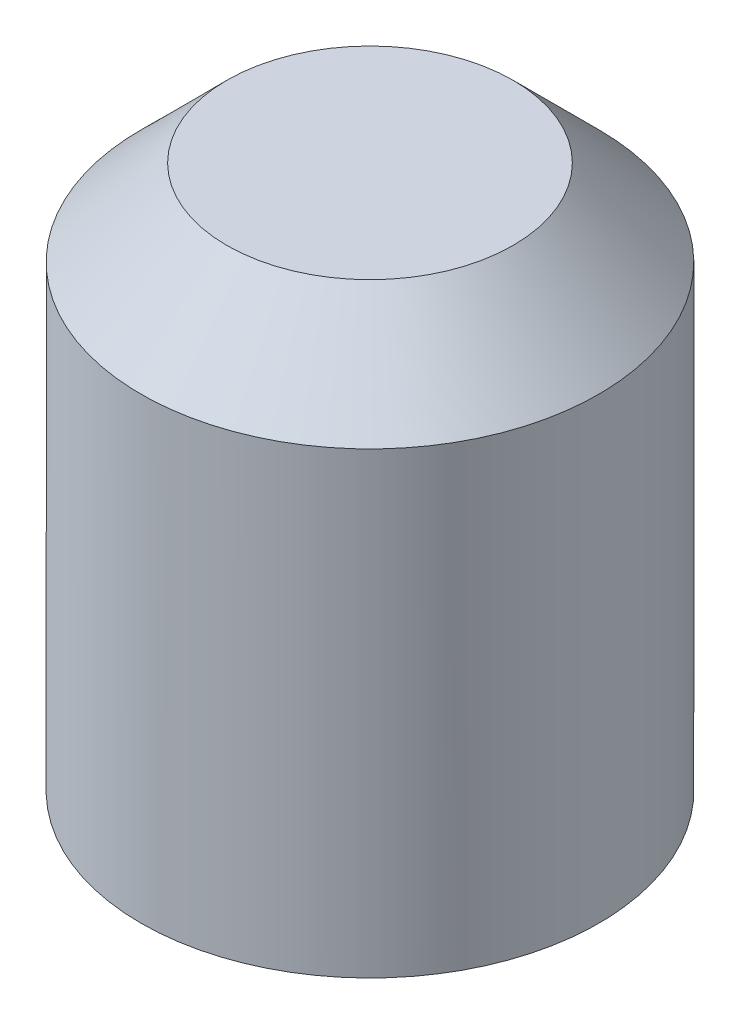
ISO-10303-21;
HEADER;
FILE_DESCRIPTION(('STEP AP214'),'2;1');
FILE_NAME('part.step','',(''),(''),'','','');
FILE_SCHEMA(('AUTOMOTIVE_DESIGN { 1 0 10303 214 1 1 1 1 }'));
ENDSEC;
DATA;
#1=APPLICATION_CONTEXT('core data for automotive mechanical design processes');
#2=APPLICATION_PROTOCOL_DEFINITION('international standard','automotive_design',2000,#1);
#3=PRODUCT_CONTEXT('',#1,'mechanical');
#4=PRODUCT('Part','Part','',(#3));
#5=PRODUCT_RELATED_PRODUCT_CATEGORY('part','',(#4));
#6=PRODUCT_DEFINITION_FORMATION('','',#4);
#7=PRODUCT_DEFINITION_CONTEXT('part definition',#1,'design');
#8=PRODUCT_DEFINITION('design','',#6,#7);
#9=PRODUCT_DEFINITION_SHAPE('','',#8);
#10=(LENGTH_UNIT() NAMED_UNIT(*) SI_UNIT(.MILLI.,.METRE.));
#11=(NAMED_UNIT(*) PLANE_ANGLE_UNIT() SI_UNIT($,.RADIAN.));
#12=(NAMED_UNIT(*) SI_UNIT($,.STERADIAN.) SOLID_ANGLE_UNIT());
#13=UNCERTAINTY_MEASURE_WITH_UNIT(LENGTH_MEASURE(1.E-05),#10,'distance_accuracy_value','');
#14=(GEOMETRIC_REPRESENTATION_CONTEXT(3) GLOBAL_UNCERTAINTY_ASSIGNED_CONTEXT((#13)) GLOBAL_UNIT_ASSIGNED_CONTEXT((#10,
#11,#12)) REPRESENTATION_CONTEXT('',''));
#15=CARTESIAN_POINT('',(0.,0.,0.));
#16=DIRECTION('',(0.,0.,1.));
#17=DIRECTION('',(1.,0.,0.));
#18=AXIS2_PLACEMENT_3D('',#15,#16,#17);
#19=CARTESIAN_POINT('',(-7.87735026918963,-10.,-1.));
#20=DIRECTION('',(0.,0.,-1.));
#21=DIRECTION('',(-1.,0.,0.));
#22=AXIS2_PLACEMENT_3D('',#19,#20,#21);
#23=PLANE('',#22);
#24=DIRECTION('',(0.,1.,0.));
#25=VECTOR('',#24,1.);
#26=CARTESIAN_POINT('',(-6.72264973081037,-10.,-1.));
#27=LINE('',#26,#25);
#28=CARTESIAN_POINT('',(-6.72264973080795,-10.0000000000346,-1.00000000000603));
#29=VERTEX_POINT('',#28);
#30=CARTESIAN_POINT('',(-6.72264973081037,-8.5,-1.));
#31=VERTEX_POINT('',#30);
#32=EDGE_CURVE('E74',#29,#31,#27,.T.);
#33=ORIENTED_EDGE('',*,*,#32,.T.);
#34=DIRECTION('',(1.,0.,0.));
#35=VECTOR('',#34,1.);
#36=CARTESIAN_POINT('',(-7.3,-8.5,-1.));
#37=LINE('',#36,#35);
#38=CARTESIAN_POINT('',(-7.87735026918963,-8.5,-0.999999999999999));
#39=VERTEX_POINT('',#38);
#40=EDGE_CURVE('E261',#31,#39,#37,.F.);
#41=ORIENTED_EDGE('',*,*,#40,.T.);
#42=DIRECTION('',(0.,1.,0.));
#43=VECTOR('',#42,1.);
#44=CARTESIAN_POINT('',(-7.87735026918963,-10.,-0.999999999999998));
#45=LINE('',#44,#43);
#46=CARTESIAN_POINT('',(-7.87735026919245,-10.0000000000686,-0.999999999999999));
#47=VERTEX_POINT('',#46);
#48=EDGE_CURVE('E77',#39,#47,#45,.F.);
#49=ORIENTED_EDGE('',*,*,#48,.T.);
#50=CARTESIAN_POINT('',(-6.72264973081249,-10.0000000000303,-1.));
#51=CARTESIAN_POINT('',(-6.77004446291757,-9.98631688646596,-1.));
#52=CARTESIAN_POINT('',(-6.81781412942871,-9.9737896099871,-1.));
#53=CARTESIAN_POINT('',(-6.91412944760533,-9.95164920318649,-1.));
#54=CARTESIAN_POINT('',(-6.96267658445572,-9.94204259308874,-1.));
#55=CARTESIAN_POINT('',(-7.05922611584881,-9.9265940010351,-1.));
#56=CARTESIAN_POINT('',(-7.10721491698777,-9.92066965365338,-1.));
#57=CARTESIAN_POINT('',(-7.20346938392045,-9.9127165686833,-1.));
#58=CARTESIAN_POINT('',(-7.25173469196023,-9.91068360254859,-1.));
#59=CARTESIAN_POINT('',(-7.34826530804043,-9.91068360254859,-1.));
#60=CARTESIAN_POINT('',(-7.39653061608086,-9.91271656868335,-1.));
#61=CARTESIAN_POINT('',(-7.49278508301485,-9.92066965365365,-1.));
#62=CARTESIAN_POINT('',(-7.54077388415445,-9.92659400103553,-1.));
#63=CARTESIAN_POINT('',(-7.63732341554885,-9.94204259308957,-1.));
#64=CARTESIAN_POINT('',(-7.6858705523999,-9.95164920318757,-1.));
#65=CARTESIAN_POINT('',(-7.78218587057781,-9.97378960998872,-1.));
#66=CARTESIAN_POINT('',(-7.82995553708958,-9.98631688646789,-1.));
#67=CARTESIAN_POINT('',(-7.87735026919529,-10.0000000000325,-1.));
#68=B_SPLINE_CURVE_WITH_KNOTS('',3,(#50,#51,#52,#53,#54,#55,#56,#57,#58,#59,#60,#61,#62,#63,#64,
#65,#66,#67),.UNSPECIFIED.,.F.,.F.,(4,2,2,2,2,2,2,2,4),(0.,0.148036697958489,0.296401493043749,
0.44131542958406,0.586071806661002,0.730828183739915,0.875742120282206,1.02410691536954,
1.17214361333009),.UNSPECIFIED.);
#69=EDGE_CURVE('E21',#29,#47,#68,.T.);
#70=ORIENTED_EDGE('',*,*,#69,.F.);
#71=EDGE_LOOP('',(#33,#41,#49,#70));
#72=FACE_BOUND('',#71,.T.);
#73=ADVANCED_FACE('F17',(#72),#23,.F.);
#74=CARTESIAN_POINT('',(-6.72264973081037,-10.,1.));
#75=DIRECTION('',(0.,0.,1.));
#76=DIRECTION('',(1.,0.,0.));
#77=AXIS2_PLACEMENT_3D('',#74,#75,#76);
#78=PLANE('',#77);
#79=DIRECTION('',(0.,1.,0.));
#80=VECTOR('',#79,1.);
#81=CARTESIAN_POINT('',(-7.87735026918963,-10.,1.));
#82=LINE('',#81,#80);
#83=CARTESIAN_POINT('',(-7.87735026918372,-10.0000000000431,1.00000000001023));
#84=VERTEX_POINT('',#83);
#85=CARTESIAN_POINT('',(-7.87735026918963,-8.5,1.));
#86=VERTEX_POINT('',#85);
#87=EDGE_CURVE('E225',#84,#86,#82,.T.);
#88=ORIENTED_EDGE('',*,*,#87,.T.);
#89=DIRECTION('',(1.,0.,0.));
#90=VECTOR('',#89,1.);
#91=CARTESIAN_POINT('',(-7.3,-8.5,1.));
#92=LINE('',#91,#90);
#93=CARTESIAN_POINT('',(-6.72264973081037,-8.5,0.999999999999999));
#94=VERTEX_POINT('',#93);
#95=EDGE_CURVE('E170',#86,#94,#92,.T.);
#96=ORIENTED_EDGE('',*,*,#95,.T.);
#97=DIRECTION('',(0.,1.,0.));
#98=VECTOR('',#97,1.);
#99=CARTESIAN_POINT('',(-6.72264973081037,-10.,0.999999999999998));
#100=LINE('',#99,#98);
#101=CARTESIAN_POINT('',(-6.72264973080584,-10.0000000000431,1.00000000000421));
#102=VERTEX_POINT('',#101);
#103=EDGE_CURVE('E89',#94,#102,#100,.F.);
#104=ORIENTED_EDGE('',*,*,#103,.T.);
#105=CARTESIAN_POINT('',(-7.87735026918543,-10.0000000000385,1.));
#106=CARTESIAN_POINT('',(-7.82995553708064,-9.98631688647293,1.));
#107=CARTESIAN_POINT('',(-7.78218587056974,-9.97378960999294,1.));
#108=CARTESIAN_POINT('',(-7.68587055239344,-9.9516492031903,1.));
#109=CARTESIAN_POINT('',(-7.63732341554314,-9.94204259309165,1.));
#110=CARTESIAN_POINT('',(-7.54077388415032,-9.9265940010366,1.));
#111=CARTESIAN_POINT('',(-7.49278508301155,-9.92066965365434,1.));
#112=CARTESIAN_POINT('',(-7.39653061607918,-9.91271656868353,1.));
#113=CARTESIAN_POINT('',(-7.34826530803955,-9.91068360254864,1.));
#114=CARTESIAN_POINT('',(-7.25173469196029,-9.91068360254864,1.));
#115=CARTESIAN_POINT('',(-7.20346938392067,-9.91271656868354,1.));
#116=CARTESIAN_POINT('',(-7.10721491698833,-9.92066965365435,1.));
#117=CARTESIAN_POINT('',(-7.05922611584958,-9.92659400103662,1.));
#118=CARTESIAN_POINT('',(-6.96267658445678,-9.94204259309167,1.));
#119=CARTESIAN_POINT('',(-6.9141294476065,-9.95164920319031,1.));
#120=CARTESIAN_POINT('',(-6.81781412943023,-9.97378960999295,1.));
#121=CARTESIAN_POINT('',(-6.77004446291934,-9.98631688647294,1.));
#122=CARTESIAN_POINT('',(-6.72264973081457,-10.0000000000385,1.));
#123=B_SPLINE_CURVE_WITH_KNOTS('',3,(#105,#106,#107,#108,#109,#110,#111,#112,#113,#114,#115,
#116,#117,#118,#119,#120,#121,#122),.UNSPECIFIED.,.F.,.F.,(4,2,2,2,2,2,2,2,4),(0.,
0.148036697958658,0.296401493044158,0.441315429584087,0.586071806660615,0.730828183737098,
0.875742120276983,1.02410691536244,1.17214361332105),.UNSPECIFIED.);
#124=EDGE_CURVE('E78',#84,#102,#123,.T.);
#125=ORIENTED_EDGE('',*,*,#124,.F.);
#126=EDGE_LOOP('',(#88,#96,#104,#125));
#127=FACE_BOUND('',#126,.T.);
#128=ADVANCED_FACE('F162',(#127),#78,.F.);
#129=CARTESIAN_POINT('',(-7.3,-8.5,0.));
#130=DIRECTION('',(0.,1.,0.));
#131=DIRECTION('',(0.,0.,1.));
#132=AXIS2_PLACEMENT_3D('',#129,#130,#131);
#133=PLANE('',#132);
#134=ORIENTED_EDGE('',*,*,#40,.F.);
#135=DIRECTION('',(-0.5,0.,-0.866025403784439));
#136=VECTOR('',#135,1.);
#137=CARTESIAN_POINT('',(-6.72264973081037,-8.5,-1.));
#138=LINE('',#137,#136);
#139=CARTESIAN_POINT('',(-6.14529946162075,-8.5,0.));
#140=VERTEX_POINT('',#139);
#141=EDGE_CURVE('E88',#31,#140,#138,.F.);
#142=ORIENTED_EDGE('',*,*,#141,.T.);
#143=DIRECTION('',(0.5,0.,-0.866025403784439));
#144=VECTOR('',#143,1.);
#145=CARTESIAN_POINT('',(-6.14529946162075,-8.5,0.));
#146=LINE('',#145,#144);
#147=EDGE_CURVE('E251',#140,#94,#146,.F.);
#148=ORIENTED_EDGE('',*,*,#147,.T.);
#149=ORIENTED_EDGE('',*,*,#95,.F.);
#150=DIRECTION('',(0.5,0.,0.866025403784439));
#151=VECTOR('',#150,1.);
#152=CARTESIAN_POINT('',(-7.87735026918963,-8.5,1.));
#153=LINE('',#152,#151);
#154=CARTESIAN_POINT('',(-8.45470053837925,-8.5,0.));
#155=VERTEX_POINT('',#154);
#156=EDGE_CURVE('E227',#86,#155,#153,.F.);
#157=ORIENTED_EDGE('',*,*,#156,.T.);
#158=DIRECTION('',(-0.5,0.,0.866025403784439));
#159=VECTOR('',#158,1.);
#160=CARTESIAN_POINT('',(-8.45470053837925,-8.5,0.));
#161=LINE('',#160,#159);
#162=EDGE_CURVE('E233',#155,#39,#161,.F.);
#163=ORIENTED_EDGE('',*,*,#162,.T.);
#164=EDGE_LOOP('',(#134,#142,#148,#149,#157,#163));
#165=FACE_BOUND('',#164,.T.);
#166=ADVANCED_FACE('F159',(#165),#133,.F.);
#167=CARTESIAN_POINT('',(-6.14529946162075,-10.,0.));
#168=DIRECTION('',(0.866025403784439,0.,0.5));
#169=DIRECTION('',(0.5,0.,-0.866025403784439));
#170=AXIS2_PLACEMENT_3D('',#167,#168,#169);
#171=PLANE('',#170);
#172=ORIENTED_EDGE('',*,*,#103,.F.);
#173=ORIENTED_EDGE('',*,*,#147,.F.);
#174=DIRECTION('',(0.,1.,0.));
#175=VECTOR('',#174,1.);
#176=CARTESIAN_POINT('',(-6.14529946162075,-10.,0.));
#177=LINE('',#176,#175);
#178=CARTESIAN_POINT('',(-6.14529946161431,-10.0000000000434,8.96002003653991E-13));
#179=VERTEX_POINT('',#178);
#180=EDGE_CURVE('E243',#140,#179,#177,.F.);
#181=ORIENTED_EDGE('',*,*,#180,.T.);
#182=CARTESIAN_POINT('',(-6.14529946162179,-10.0000000000391,1.79265636801373E-12));
#183=CARTESIAN_POINT('',(-6.17067050939324,-9.9853477726028,0.0439439437832082));
#184=CARTESIAN_POINT('',(-6.19626055968811,-9.97202233858992,0.0882672110621716));
#185=CARTESIAN_POINT('',(-6.24788373488103,-9.94876319374054,0.177681173344336));
#186=CARTESIAN_POINT('',(-6.27391777672441,-9.93883771020972,0.222773456543446));
#187=CARTESIAN_POINT('',(-6.32566323358121,-9.92338797951412,0.312399216880281));
#188=CARTESIAN_POINT('',(-6.3513666891231,-9.91776089383968,0.356918907808924));
#189=CARTESIAN_POINT('',(-6.40289448035908,-9.91104458410664,0.446167660231435));
#190=CARTESIAN_POINT('',(-6.42871862889216,-9.90994979702856,0.490896397552939));
#191=CARTESIAN_POINT('',(-6.47696828007823,-9.9122331451188,0.574467244854695));
#192=CARTESIAN_POINT('',(-6.49940102298446,-9.91505064264945,0.613321895321416));
#193=CARTESIAN_POINT('',(-6.54412036679432,-9.92397865040011,0.690778070881225));
#194=CARTESIAN_POINT('',(-6.56640681314112,-9.93009220742516,0.729379328274042));
#195=CARTESIAN_POINT('',(-6.61121828301658,-9.94537491670948,0.80699507086018));
#196=CARTESIAN_POINT('',(-6.63373763791005,-9.95460882114915,0.845999737689352));
#197=CARTESIAN_POINT('',(-6.67844056866225,-9.97556588045897,0.923427484999392));
#198=CARTESIAN_POINT('',(-6.7006247167754,-9.98728411441501,0.96185155665401));
#199=CARTESIAN_POINT('',(-6.72264973080827,-10.0000000000385,0.999999999996361));
#200=B_SPLINE_CURVE_WITH_KNOTS('',3,(#182,#183,#184,#185,#186,#187,#188,#189,#190,#191,#192,
#193,#194,#195,#196,#197,#198,#199),.UNSPECIFIED.,.F.,.F.,(4,2,2,2,2,2,2,2,4),(0.,
0.158508005777772,0.31739690851222,0.472353803074637,0.627120444446608,0.761853891312512,
0.896712096892625,1.03456081123844,1.17213898675028),.UNSPECIFIED.);
#201=EDGE_CURVE('E96',#179,#102,#200,.T.);
#202=ORIENTED_EDGE('',*,*,#201,.T.);
#203=EDGE_LOOP('',(#172,#173,#181,#202));
#204=FACE_BOUND('',#203,.T.);
#205=ADVANCED_FACE('F154',(#204),#171,.F.);
#206=CARTESIAN_POINT('',(-6.72264973081037,-10.,-1.));
#207=DIRECTION('',(0.866025403784439,0.,-0.5));
#208=DIRECTION('',(-0.5,0.,-0.866025403784439));
#209=AXIS2_PLACEMENT_3D('',#206,#207,#208);
#210=PLANE('',#209);
#211=ORIENTED_EDGE('',*,*,#180,.F.);
#212=ORIENTED_EDGE('',*,*,#141,.F.);
#213=ORIENTED_EDGE('',*,*,#32,.F.);
#214=CARTESIAN_POINT('',(-6.72264973080814,-10.0000000000384,-0.999999999996138));
#215=CARTESIAN_POINT('',(-6.69727868303671,-9.98534777260216,-0.956056056214756));
#216=CARTESIAN_POINT('',(-6.67168863274185,-9.97202233858934,-0.911732788935826));
#217=CARTESIAN_POINT('',(-6.62006545754897,-9.94876319374009,-0.822318826653732));
#218=CARTESIAN_POINT('',(-6.59403141570562,-9.93883771020933,-0.77722654345466));
#219=CARTESIAN_POINT('',(-6.54228595884886,-9.92338797951387,-0.6876007831179));
#220=CARTESIAN_POINT('',(-6.51658250330699,-9.91776089383949,-0.643081092189295));
#221=CARTESIAN_POINT('',(-6.46505471207106,-9.91104458410658,-0.553832339766865));
#222=CARTESIAN_POINT('',(-6.43923056353801,-9.90994979702855,-0.509103602445403));
#223=CARTESIAN_POINT('',(-6.39098091235194,-9.9122331451189,-0.425532755143669));
#224=CARTESIAN_POINT('',(-6.3685481694457,-9.91505064264959,-0.386678104676925));
#225=CARTESIAN_POINT('',(-6.32382882563582,-9.92397865040035,-0.309221929117074));
#226=CARTESIAN_POINT('',(-6.30154237928901,-9.93009220742545,-0.270620671724238));
#227=CARTESIAN_POINT('',(-6.25673090941353,-9.94537491670988,-0.193004929138063));
#228=CARTESIAN_POINT('',(-6.23421155452005,-9.95460882114959,-0.154000262308873));
#229=CARTESIAN_POINT('',(-6.18950862376783,-9.97556588045951,-0.0765725149987993));
#230=CARTESIAN_POINT('',(-6.16732447565466,-9.98728411441559,-0.0381484433441645));
#231=CARTESIAN_POINT('',(-6.14529946162178,-10.0000000000391,-1.79705856295771E-12));
#232=B_SPLINE_CURVE_WITH_KNOTS('',3,(#214,#215,#216,#217,#218,#219,#220,#221,#222,#223,#224,
#225,#226,#227,#228,#229,#230,#231),.UNSPECIFIED.,.F.,.F.,(4,2,2,2,2,2,2,2,4),(0.,
0.158508005777613,0.317396908511899,0.472353803074163,0.627120444445983,0.761853891311973,
0.896712096892174,1.03456081123807,1.17213898675001),.UNSPECIFIED.);
#233=EDGE_CURVE('E85',#29,#179,#232,.T.);
#234=ORIENTED_EDGE('',*,*,#233,.T.);
#235=EDGE_LOOP('',(#211,#212,#213,#234));
#236=FACE_BOUND('',#235,.T.);
#237=ADVANCED_FACE('F84',(#236),#210,.F.);
#238=CARTESIAN_POINT('',(-8.45470053837925,-10.,0.));
#239=DIRECTION('',(-0.866025403784439,0.,-0.5));
#240=DIRECTION('',(-0.5,0.,0.866025403784439));
#241=AXIS2_PLACEMENT_3D('',#238,#239,#240);
#242=PLANE('',#241);
#243=ORIENTED_EDGE('',*,*,#48,.F.);
#244=ORIENTED_EDGE('',*,*,#162,.F.);
#245=DIRECTION('',(0.,1.,0.));
#246=VECTOR('',#245,1.);
#247=CARTESIAN_POINT('',(-8.45470053837925,-10.,0.));
#248=LINE('',#247,#246);
#249=CARTESIAN_POINT('',(-8.45470053838569,-10.0000000000434,-8.96428030057795E-13));
#250=VERTEX_POINT('',#249);
#251=EDGE_CURVE('E39',#155,#250,#248,.F.);
#252=ORIENTED_EDGE('',*,*,#251,.T.);
#253=CARTESIAN_POINT('',(-8.45470053837821,-10.0000000000391,-1.79274291452481E-12));
#254=CARTESIAN_POINT('',(-8.42932949060676,-9.9853477726028,-0.0439439437832108));
#255=CARTESIAN_POINT('',(-8.40373944031188,-9.97202233858992,-0.0882672110621767));
#256=CARTESIAN_POINT('',(-8.35211626511896,-9.94876319374054,-0.177681173344346));
#257=CARTESIAN_POINT('',(-8.32608222327558,-9.93883771020971,-0.222773456543458));
#258=CARTESIAN_POINT('',(-8.27433676641878,-9.92338797951412,-0.312399216880293));
#259=CARTESIAN_POINT('',(-8.2486333108769,-9.91776089383968,-0.356918907808935));
#260=CARTESIAN_POINT('',(-8.19710551964092,-9.91104458410664,-0.44616766023144));
#261=CARTESIAN_POINT('',(-8.17128137110784,-9.90994979702856,-0.490896397552942));
#262=CARTESIAN_POINT('',(-8.12303171992145,-9.91223314511882,-0.574467244855244));
#263=CARTESIAN_POINT('',(-8.10059897701491,-9.91505064264953,-0.613321895322514));
#264=CARTESIAN_POINT('',(-8.05587963320442,-9.9239786504004,-0.690778070883412));
#265=CARTESIAN_POINT('',(-8.03359318685731,-9.93009220742561,-0.729379328276768));
#266=CARTESIAN_POINT('',(-7.98878171698122,-9.94537491671032,-0.806995070863998));
#267=CARTESIAN_POINT('',(-7.96626236208743,-9.95460882115022,-0.845999737693721));
#268=CARTESIAN_POINT('',(-7.9215594313346,-9.97556588046056,-0.923427485004844));
#269=CARTESIAN_POINT('',(-7.89937528322114,-9.98728411441689,-0.961851556659993));
#270=CARTESIAN_POINT('',(-7.87735026918797,-10.0000000000407,-1.00000000000287));
#271=B_SPLINE_CURVE_WITH_KNOTS('',3,(#253,#254,#255,#256,#257,#258,#259,#260,#261,#262,#263,
#264,#265,#266,#267,#268,#269,#270),.UNSPECIFIED.,.F.,.F.,(4,2,2,2,2,2,2,2,4),(0.,
0.158508005777781,0.317396908512238,0.472353803074646,0.627120444446608,0.761853891314415,
0.896712096896439,1.03456081124426,1.1721389867581),.UNSPECIFIED.);
#272=EDGE_CURVE('E95',#250,#47,#271,.T.);
#273=ORIENTED_EDGE('',*,*,#272,.T.);
#274=EDGE_LOOP('',(#243,#244,#252,#273));
#275=FACE_BOUND('',#274,.T.);
#276=ADVANCED_FACE('F153',(#275),#242,.F.);
#277=CARTESIAN_POINT('',(-7.87735026918963,-10.,1.));
#278=DIRECTION('',(-0.866025403784439,0.,0.5));
#279=DIRECTION('',(0.5,0.,0.866025403784439));
#280=AXIS2_PLACEMENT_3D('',#277,#278,#279);
#281=PLANE('',#280);
#282=ORIENTED_EDGE('',*,*,#251,.F.);
#283=ORIENTED_EDGE('',*,*,#156,.F.);
#284=ORIENTED_EDGE('',*,*,#87,.F.);
#285=CARTESIAN_POINT('',(-7.87735026919173,-10.0000000000385,0.999999999996362));
#286=CARTESIAN_POINT('',(-7.90272131696317,-9.98534777260223,0.956056056214976));
#287=CARTESIAN_POINT('',(-7.92831136725802,-9.97202233858941,0.911732788936042));
#288=CARTESIAN_POINT('',(-7.97993454245091,-9.94876319374014,0.822318826653941));
#289=CARTESIAN_POINT('',(-8.00596858429427,-9.93883771020938,0.777226543454865));
#290=CARTESIAN_POINT('',(-8.05771404115103,-9.9233879795139,0.687600783118097));
#291=CARTESIAN_POINT('',(-8.0834174966929,-9.91776089383952,0.643081092189487));
#292=CARTESIAN_POINT('',(-8.13494528792883,-9.91104458410658,0.553832339767048));
#293=CARTESIAN_POINT('',(-8.16076943646189,-9.90994979702855,0.509103602445582));
#294=CARTESIAN_POINT('',(-8.20901908764796,-9.91223314511889,0.425532755143828));
#295=CARTESIAN_POINT('',(-8.23145183055422,-9.91505064264958,0.38667810467707));
#296=CARTESIAN_POINT('',(-8.27617117436411,-9.92397865040034,0.30922192911719));
#297=CARTESIAN_POINT('',(-8.29845762071093,-9.93009220742544,0.270620671724339));
#298=CARTESIAN_POINT('',(-8.34326909058643,-9.94537491670986,0.193004929138134));
#299=CARTESIAN_POINT('',(-8.36578844547992,-9.95460882114958,0.15400026230893));
#300=CARTESIAN_POINT('',(-8.41049137623216,-9.9755658804595,0.0765725149988267));
#301=CARTESIAN_POINT('',(-8.43267552434533,-9.98728411441559,0.0381484433441777));
#302=CARTESIAN_POINT('',(-8.45470053837822,-10.0000000000391,1.79607225173968E-12));
#303=B_SPLINE_CURVE_WITH_KNOTS('',3,(#285,#286,#287,#288,#289,#290,#291,#292,#293,#294,#295,
#296,#297,#298,#299,#300,#301,#302),.UNSPECIFIED.,.F.,.F.,(4,2,2,2,2,2,2,2,4),(0.,
0.158508005777631,0.317396908511935,0.472353803074215,0.627120444446052,0.761853891312092,
0.896712096892342,1.03456081123829,1.17213898675028),.UNSPECIFIED.);
#304=EDGE_CURVE('E109',#84,#250,#303,.T.);
#305=ORIENTED_EDGE('',*,*,#304,.T.);
#306=EDGE_LOOP('',(#282,#283,#284,#305));
#307=FACE_BOUND('',#306,.T.);
#308=ADVANCED_FACE('F121',(#307),#281,.F.);
#309=CARTESIAN_POINT('',(-7.3,-10.0000000000477,0.));
#310=DIRECTION('',(0.,-1.,0.));
#311=DIRECTION('',(0.,0.,-1.));
#312=AXIS2_PLACEMENT_3D('',#309,#310,#311);
#313=CONICAL_SURFACE('',#312,1.15470053839317,1.04719755112858);
#314=ORIENTED_EDGE('',*,*,#124,.T.);
#315=CARTESIAN_POINT('',(-7.3,-10.0000000000477,0.));
#316=DIRECTION('',(0.,-1.,0.));
#317=DIRECTION('',(0.,0.,-1.));
#318=AXIS2_PLACEMENT_3D('',#315,#316,#317);
#319=CIRCLE('',#318,1.15470053839317);
#320=EDGE_CURVE('E104',#84,#102,#319,.F.);
#321=ORIENTED_EDGE('',*,*,#320,.F.);
#322=EDGE_LOOP('',(#314,#321));
#323=FACE_BOUND('',#322,.T.);
#324=ADVANCED_FACE('F171',(#323),#313,.F.);
#325=CARTESIAN_POINT('',(-7.3,-10.0000000000477,0.));
#326=DIRECTION('',(0.,-1.,0.));
#327=DIRECTION('',(0.,0.,-1.));
#328=AXIS2_PLACEMENT_3D('',#325,#326,#327);
#329=CONICAL_SURFACE('',#328,1.15470053839317,1.04719755120501);
#330=CARTESIAN_POINT('',(-7.3,-10.0000000000477,0.));
#331=DIRECTION('',(0.,-1.,0.));
#332=DIRECTION('',(0.,0.,-1.));
#333=AXIS2_PLACEMENT_3D('',#330,#331,#332);
#334=CIRCLE('',#333,1.15470053839317);
#335=EDGE_CURVE('E102',#102,#179,#334,.F.);
#336=ORIENTED_EDGE('',*,*,#335,.F.);
#337=ORIENTED_EDGE('',*,*,#201,.F.);
#338=EDGE_LOOP('',(#336,#337));
#339=FACE_BOUND('',#338,.T.);
#340=ADVANCED_FACE('F140',(#339),#329,.F.);
#341=CARTESIAN_POINT('',(-7.3,-10.0000000000477,0.));
#342=DIRECTION('',(0.,-1.,0.));
#343=DIRECTION('',(0.,0.,-1.));
#344=AXIS2_PLACEMENT_3D('',#341,#342,#343);
#345=CONICAL_SURFACE('',#344,1.15470053839317,1.04719755120501);
#346=CARTESIAN_POINT('',(-7.3,-10.0000000000477,0.));
#347=DIRECTION('',(0.,-1.,0.));
#348=DIRECTION('',(0.,0.,-1.));
#349=AXIS2_PLACEMENT_3D('',#346,#347,#348);
#350=CIRCLE('',#349,1.15470053839317);
#351=EDGE_CURVE('E67',#179,#29,#350,.F.);
#352=ORIENTED_EDGE('',*,*,#351,.F.);
#353=ORIENTED_EDGE('',*,*,#233,.F.);
#354=EDGE_LOOP('',(#352,#353));
#355=FACE_BOUND('',#354,.T.);
#356=ADVANCED_FACE('F93',(#355),#345,.F.);
#357=CARTESIAN_POINT('',(-7.3,-10.0000000001046,0.));
#358=DIRECTION('',(0.,-1.,0.));
#359=DIRECTION('',(0.,0.,-1.));
#360=AXIS2_PLACEMENT_3D('',#357,#358,#359);
#361=CONICAL_SURFACE('',#360,1.15470053850686,1.04719755117096);
#362=ORIENTED_EDGE('',*,*,#69,.T.);
#363=CARTESIAN_POINT('',(-7.3,-10.0000000001046,0.));
#364=DIRECTION('',(0.,-1.,0.));
#365=DIRECTION('',(0.,0.,-1.));
#366=AXIS2_PLACEMENT_3D('',#363,#364,#365);
#367=CIRCLE('',#366,1.15470053850686);
#368=EDGE_CURVE('E59',#29,#47,#367,.F.);
#369=ORIENTED_EDGE('',*,*,#368,.F.);
#370=EDGE_LOOP('',(#362,#369));
#371=FACE_BOUND('',#370,.T.);
#372=ADVANCED_FACE('F61',(#371),#361,.F.);
#373=CARTESIAN_POINT('',(-7.3,-10.0000000000477,0.));
#374=DIRECTION('',(0.,-1.,0.));
#375=DIRECTION('',(0.,0.,-1.));
#376=AXIS2_PLACEMENT_3D('',#373,#374,#375);
#377=CONICAL_SURFACE('',#376,1.15470053839317,1.04719755120501);
#378=CARTESIAN_POINT('',(-7.3,-10.0000000000477,0.));
#379=DIRECTION('',(0.,-1.,0.));
#380=DIRECTION('',(0.,0.,-1.));
#381=AXIS2_PLACEMENT_3D('',#378,#379,#380);
#382=CIRCLE('',#381,1.15470053839317);
#383=EDGE_CURVE('E66',#47,#250,#382,.F.);
#384=ORIENTED_EDGE('',*,*,#383,.F.);
#385=ORIENTED_EDGE('',*,*,#272,.F.);
#386=EDGE_LOOP('',(#384,#385));
#387=FACE_BOUND('',#386,.T.);
#388=ADVANCED_FACE('F128',(#387),#377,.F.);
#389=CARTESIAN_POINT('',(-7.3,-10.0000000000477,0.));
#390=DIRECTION('',(0.,-1.,0.));
#391=DIRECTION('',(0.,0.,-1.));
#392=AXIS2_PLACEMENT_3D('',#389,#390,#391);
#393=CONICAL_SURFACE('',#392,1.15470053839317,1.04719755120501);
#394=CARTESIAN_POINT('',(-7.3,-10.0000000000477,0.));
#395=DIRECTION('',(0.,-1.,0.));
#396=DIRECTION('',(0.,0.,-1.));
#397=AXIS2_PLACEMENT_3D('',#394,#395,#396);
#398=CIRCLE('',#397,1.15470053839317);
#399=EDGE_CURVE('E211',#250,#84,#398,.F.);
#400=ORIENTED_EDGE('',*,*,#399,.F.);
#401=ORIENTED_EDGE('',*,*,#304,.F.);
#402=EDGE_LOOP('',(#400,#401));
#403=FACE_BOUND('',#402,.T.);
#404=ADVANCED_FACE('F124',(#403),#393,.F.);
#405=CARTESIAN_POINT('',(-7.3,-10.,1.36260026918963));
#406=DIRECTION('',(0.,-1.,0.));
#407=DIRECTION('',(0.,0.,-1.));
#408=AXIS2_PLACEMENT_3D('',#405,#406,#407);
#409=PLANE('',#408);
#410=ORIENTED_EDGE('',*,*,#383,.T.);
#411=ORIENTED_EDGE('',*,*,#399,.T.);
#412=ORIENTED_EDGE('',*,*,#320,.T.);
#413=ORIENTED_EDGE('',*,*,#335,.T.);
#414=ORIENTED_EDGE('',*,*,#351,.T.);
#415=ORIENTED_EDGE('',*,*,#368,.T.);
#416=EDGE_LOOP('',(#410,#411,#412,#413,#414,#415));
#417=FACE_BOUND('',#416,.T.);
#418=CARTESIAN_POINT('',(-7.3,-10.0000000000149,0.));
#419=DIRECTION('',(0.,1.,0.));
#420=DIRECTION('',(0.,0.,1.));
#421=AXIS2_PLACEMENT_3D('',#418,#419,#420);
#422=CIRCLE('',#421,1.57050000012759);
#423=CARTESIAN_POINT('',(-7.3,-10.0000000000149,1.57050000012759));
#424=VERTEX_POINT('',#423);
#425=EDGE_CURVE('E207',#424,#424,#422,.T.);
#426=ORIENTED_EDGE('',*,*,#425,.F.);
#427=EDGE_LOOP('',(#426));
#428=FACE_BOUND('',#427,.T.);
#429=ADVANCED_FACE('F98',(#417,#428),#409,.T.);
#430=CARTESIAN_POINT('',(-7.3,-5.,0.624999999999999));
#431=DIRECTION('',(0.,1.,0.));
#432=DIRECTION('',(0.,0.,1.));
#433=AXIS2_PLACEMENT_3D('',#430,#431,#432);
#434=PLANE('',#433);
#435=CARTESIAN_POINT('',(-7.3,-5.00000000016598,0.));
#436=DIRECTION('',(0.,-1.,0.));
#437=DIRECTION('',(0.,0.,-1.));
#438=AXIS2_PLACEMENT_3D('',#435,#436,#437);
#439=CIRCLE('',#438,1.25000000014097);
#440=CARTESIAN_POINT('',(-7.3,-5.00000000016598,-1.25000000014097));
#441=VERTEX_POINT('',#440);
#442=EDGE_CURVE('E206',#441,#441,#439,.T.);
#443=ORIENTED_EDGE('',*,*,#442,.F.);
#444=EDGE_LOOP('',(#443));
#445=FACE_BOUND('',#444,.T.);
#446=ADVANCED_FACE('F197',(#445),#434,.T.);
#447=CARTESIAN_POINT('',(-7.3,-9.75202805938125,0.));
#448=DIRECTION('',(0.,1.,0.));
#449=DIRECTION('',(0.,0.,1.));
#450=AXIS2_PLACEMENT_3D('',#447,#448,#449);
#451=CONICAL_SURFACE('',#450,2.00000000012324,1.04719755116297);
#452=ORIENTED_EDGE('',*,*,#425,.T.);
#453=EDGE_LOOP('',(#452));
#454=FACE_BOUND('',#453,.T.);
#455=CARTESIAN_POINT('',(-7.3,-9.75202805938305,0.));
#456=DIRECTION('',(0.,-1.,0.));
#457=DIRECTION('',(0.,0.,-1.));
#458=AXIS2_PLACEMENT_3D('',#455,#456,#457);
#459=CIRCLE('',#458,2.);
#460=CARTESIAN_POINT('',(-7.3,-9.75202805938305,-2.));
#461=VERTEX_POINT('',#460);
#462=EDGE_CURVE('E31',#461,#461,#459,.F.);
#463=ORIENTED_EDGE('',*,*,#462,.F.);
#464=EDGE_LOOP('',(#463));
#465=FACE_BOUND('',#464,.T.);
#466=ADVANCED_FACE('F190',(#454,#465),#451,.T.);
#467=CARTESIAN_POINT('',(-7.3,-5.74999999992087,0.));
#468=DIRECTION('',(0.,-1.,0.));
#469=DIRECTION('',(0.,0.,-1.));
#470=AXIS2_PLACEMENT_3D('',#467,#468,#469);
#471=CONICAL_SURFACE('',#470,1.99999999995271,0.785398163435344);
#472=ORIENTED_EDGE('',*,*,#442,.T.);
#473=EDGE_LOOP('',(#472));
#474=FACE_BOUND('',#473,.T.);
#475=CARTESIAN_POINT('',(-7.3,-5.75,0.));
#476=DIRECTION('',(0.,-1.,0.));
#477=DIRECTION('',(0.,0.,-1.));
#478=AXIS2_PLACEMENT_3D('',#475,#476,#477);
#479=CIRCLE('',#478,2.);
#480=CARTESIAN_POINT('',(-7.3,-5.75,-2.));
#481=VERTEX_POINT('',#480);
#482=EDGE_CURVE('E11',#481,#481,#479,.T.);
#483=ORIENTED_EDGE('',*,*,#482,.F.);
#484=EDGE_LOOP('',(#483));
#485=FACE_BOUND('',#484,.T.);
#486=ADVANCED_FACE('F184',(#474,#485),#471,.T.);
#487=CARTESIAN_POINT('',(-7.3,-7.75101402969153,0.));
#488=DIRECTION('',(0.,-1.,0.));
#489=DIRECTION('',(0.,0.,-1.));
#490=AXIS2_PLACEMENT_3D('',#487,#488,#489);
#491=CYLINDRICAL_SURFACE('',#490,2.);
#492=ORIENTED_EDGE('',*,*,#462,.T.);
#493=EDGE_LOOP('',(#492));
#494=FACE_BOUND('',#493,.T.);
#495=ORIENTED_EDGE('',*,*,#482,.T.);
#496=EDGE_LOOP('',(#495));
#497=FACE_BOUND('',#496,.T.);
#498=ADVANCED_FACE('F182',(#494,#497),#491,.T.);
#499=CLOSED_SHELL('',(#73,#128,#166,#205,#237,#276,#308,#324,#340,#356,#372,#388,#404,#429,#446,
#466,#486,#498));
#500=MANIFOLD_SOLID_BREP('B1',#499);
#501=ADVANCED_BREP_SHAPE_REPRESENTATION('',(#18,#500),#14);
#502=SHAPE_DEFINITION_REPRESENTATION(#9,#501);
ENDSEC;
END-ISO-10303-21;
